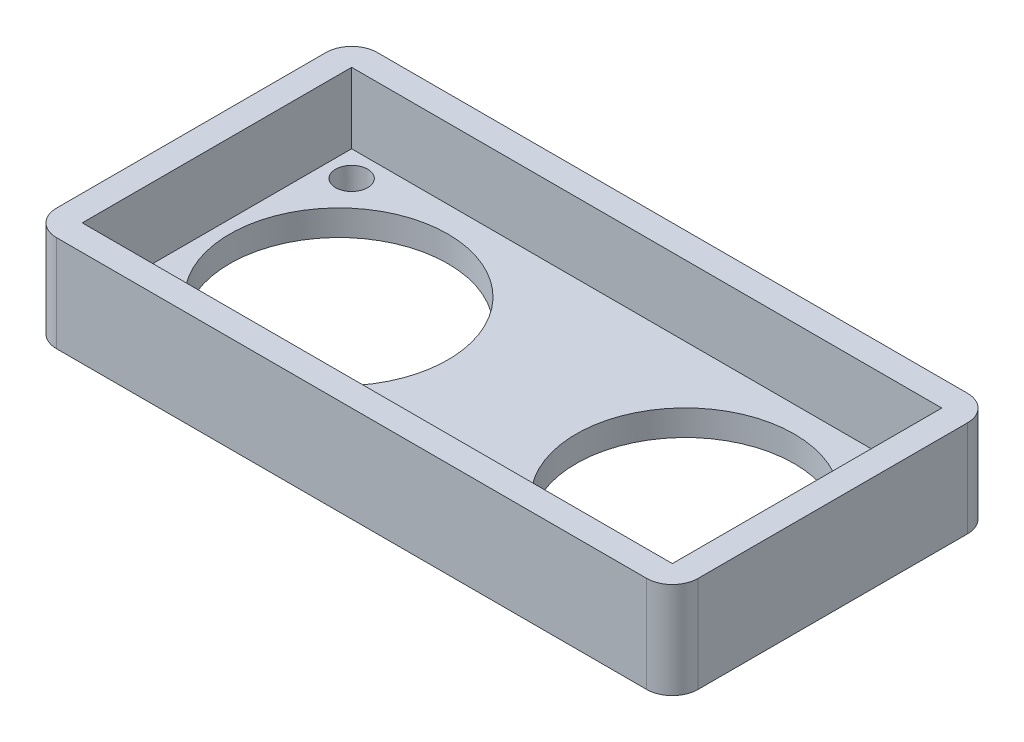
ISO-10303-21;
HEADER;
FILE_DESCRIPTION(('STEP AP214'),'2;1');
FILE_NAME('part.step','',(''),(''),'','','');
FILE_SCHEMA(('AUTOMOTIVE_DESIGN { 1 0 10303 214 1 1 1 1 }'));
ENDSEC;
DATA;
#1=APPLICATION_CONTEXT('core data for automotive mechanical design processes');
#2=APPLICATION_PROTOCOL_DEFINITION('international standard','automotive_design',2000,#1);
#3=PRODUCT_CONTEXT('',#1,'mechanical');
#4=PRODUCT('Part','Part','',(#3));
#5=PRODUCT_RELATED_PRODUCT_CATEGORY('part','',(#4));
#6=PRODUCT_DEFINITION_FORMATION('','',#4);
#7=PRODUCT_DEFINITION_CONTEXT('part definition',#1,'design');
#8=PRODUCT_DEFINITION('design','',#6,#7);
#9=PRODUCT_DEFINITION_SHAPE('','',#8);
#10=(LENGTH_UNIT() NAMED_UNIT(*) SI_UNIT(.MILLI.,.METRE.));
#11=(NAMED_UNIT(*) PLANE_ANGLE_UNIT() SI_UNIT($,.RADIAN.));
#12=(NAMED_UNIT(*) SI_UNIT($,.STERADIAN.) SOLID_ANGLE_UNIT());
#13=UNCERTAINTY_MEASURE_WITH_UNIT(LENGTH_MEASURE(1.E-05),#10,'distance_accuracy_value','');
#14=(GEOMETRIC_REPRESENTATION_CONTEXT(3) GLOBAL_UNCERTAINTY_ASSIGNED_CONTEXT((#13)) GLOBAL_UNIT_ASSIGNED_CONTEXT((#10,
#11,#12)) REPRESENTATION_CONTEXT('',''));
#15=CARTESIAN_POINT('',(0.,0.,0.));
#16=DIRECTION('',(0.,0.,1.));
#17=DIRECTION('',(1.,0.,0.));
#18=AXIS2_PLACEMENT_3D('',#15,#16,#17);
#19=CARTESIAN_POINT('',(23.,2.,-10.5));
#20=DIRECTION('',(0.,-1.,0.));
#21=DIRECTION('',(0.,0.,-1.));
#22=AXIS2_PLACEMENT_3D('',#19,#20,#21);
#23=CYLINDRICAL_SURFACE('',#22,2.);
#24=CARTESIAN_POINT('',(23.,0.,-10.5));
#25=DIRECTION('',(0.,1.,0.));
#26=DIRECTION('',(0.,0.,1.));
#27=AXIS2_PLACEMENT_3D('',#24,#25,#26);
#28=CIRCLE('',#27,2.);
#29=CARTESIAN_POINT('',(25.,0.,-10.5));
#30=VERTEX_POINT('',#29);
#31=CARTESIAN_POINT('',(23.,0.,-12.5));
#32=VERTEX_POINT('',#31);
#33=EDGE_CURVE('E186',#30,#32,#28,.T.);
#34=ORIENTED_EDGE('',*,*,#33,.T.);
#35=DIRECTION('',(0.,-1.,0.));
#36=VECTOR('',#35,1.);
#37=CARTESIAN_POINT('',(23.,2.,-12.5));
#38=LINE('',#37,#36);
#39=CARTESIAN_POINT('',(23.,7.5,-12.5));
#40=VERTEX_POINT('',#39);
#41=EDGE_CURVE('E11',#40,#32,#38,.T.);
#42=ORIENTED_EDGE('',*,*,#41,.F.);
#43=CARTESIAN_POINT('',(23.,7.5,-10.5));
#44=DIRECTION('',(0.,1.,0.));
#45=DIRECTION('',(0.,0.,1.));
#46=AXIS2_PLACEMENT_3D('',#43,#44,#45);
#47=CIRCLE('',#46,2.);
#48=CARTESIAN_POINT('',(25.,7.5,-10.5));
#49=VERTEX_POINT('',#48);
#50=EDGE_CURVE('E139',#49,#40,#47,.T.);
#51=ORIENTED_EDGE('',*,*,#50,.F.);
#52=DIRECTION('',(0.,-1.,0.));
#53=VECTOR('',#52,1.);
#54=CARTESIAN_POINT('',(25.,2.,-10.5));
#55=LINE('',#54,#53);
#56=EDGE_CURVE('E203',#49,#30,#55,.T.);
#57=ORIENTED_EDGE('',*,*,#56,.T.);
#58=EDGE_LOOP('',(#34,#42,#51,#57));
#59=FACE_BOUND('',#58,.T.);
#60=ADVANCED_FACE('F35',(#59),#23,.T.);
#61=CARTESIAN_POINT('',(-23.,2.,-12.5));
#62=DIRECTION('',(0.,0.,1.));
#63=DIRECTION('',(1.,0.,0.));
#64=AXIS2_PLACEMENT_3D('',#61,#62,#63);
#65=PLANE('',#64);
#66=DIRECTION('',(-1.,0.,0.));
#67=VECTOR('',#66,1.);
#68=CARTESIAN_POINT('',(-23.,0.,-12.5));
#69=LINE('',#68,#67);
#70=CARTESIAN_POINT('',(-23.,0.,-12.5));
#71=VERTEX_POINT('',#70);
#72=EDGE_CURVE('E189',#32,#71,#69,.T.);
#73=ORIENTED_EDGE('',*,*,#72,.T.);
#74=DIRECTION('',(0.,-1.,0.));
#75=VECTOR('',#74,1.);
#76=CARTESIAN_POINT('',(-23.,2.,-12.5));
#77=LINE('',#76,#75);
#78=CARTESIAN_POINT('',(-23.,7.5,-12.5));
#79=VERTEX_POINT('',#78);
#80=EDGE_CURVE('E43',#79,#71,#77,.T.);
#81=ORIENTED_EDGE('',*,*,#80,.F.);
#82=DIRECTION('',(-1.,0.,0.));
#83=VECTOR('',#82,1.);
#84=CARTESIAN_POINT('',(23.,7.5,-12.5));
#85=LINE('',#84,#83);
#86=EDGE_CURVE('E165',#40,#79,#85,.T.);
#87=ORIENTED_EDGE('',*,*,#86,.F.);
#88=ORIENTED_EDGE('',*,*,#41,.T.);
#89=EDGE_LOOP('',(#73,#81,#87,#88));
#90=FACE_BOUND('',#89,.T.);
#91=ADVANCED_FACE('F296',(#90),#65,.F.);
#92=CARTESIAN_POINT('',(-23.,2.,-10.5));
#93=DIRECTION('',(0.,-1.,0.));
#94=DIRECTION('',(0.,0.,-1.));
#95=AXIS2_PLACEMENT_3D('',#92,#93,#94);
#96=CYLINDRICAL_SURFACE('',#95,2.);
#97=CARTESIAN_POINT('',(-23.,0.,-10.5));
#98=DIRECTION('',(0.,1.,0.));
#99=DIRECTION('',(0.,0.,1.));
#100=AXIS2_PLACEMENT_3D('',#97,#98,#99);
#101=CIRCLE('',#100,2.);
#102=CARTESIAN_POINT('',(-25.,0.,-10.5));
#103=VERTEX_POINT('',#102);
#104=EDGE_CURVE('E191',#71,#103,#101,.T.);
#105=ORIENTED_EDGE('',*,*,#104,.T.);
#106=DIRECTION('',(0.,-1.,0.));
#107=VECTOR('',#106,1.);
#108=CARTESIAN_POINT('',(-25.,2.,-10.5));
#109=LINE('',#108,#107);
#110=CARTESIAN_POINT('',(-25.,7.5,-10.5));
#111=VERTEX_POINT('',#110);
#112=EDGE_CURVE('E218',#111,#103,#109,.T.);
#113=ORIENTED_EDGE('',*,*,#112,.F.);
#114=CARTESIAN_POINT('',(-23.,7.5,-10.5));
#115=DIRECTION('',(0.,1.,0.));
#116=DIRECTION('',(0.,0.,1.));
#117=AXIS2_PLACEMENT_3D('',#114,#115,#116);
#118=CIRCLE('',#117,2.);
#119=EDGE_CURVE('E168',#79,#111,#118,.T.);
#120=ORIENTED_EDGE('',*,*,#119,.F.);
#121=ORIENTED_EDGE('',*,*,#80,.T.);
#122=EDGE_LOOP('',(#105,#113,#120,#121));
#123=FACE_BOUND('',#122,.T.);
#124=ADVANCED_FACE('F294',(#123),#96,.T.);
#125=CARTESIAN_POINT('',(-25.,2.,-10.5));
#126=DIRECTION('',(1.,0.,0.));
#127=DIRECTION('',(0.,0.,-1.));
#128=AXIS2_PLACEMENT_3D('',#125,#126,#127);
#129=PLANE('',#128);
#130=DIRECTION('',(0.,0.,1.));
#131=VECTOR('',#130,1.);
#132=CARTESIAN_POINT('',(-25.,0.,-10.5));
#133=LINE('',#132,#131);
#134=CARTESIAN_POINT('',(-25.,0.,10.5));
#135=VERTEX_POINT('',#134);
#136=EDGE_CURVE('E193',#103,#135,#133,.T.);
#137=ORIENTED_EDGE('',*,*,#136,.T.);
#138=DIRECTION('',(0.,-1.,0.));
#139=VECTOR('',#138,1.);
#140=CARTESIAN_POINT('',(-25.,2.,10.5));
#141=LINE('',#140,#139);
#142=CARTESIAN_POINT('',(-25.,7.5,10.5));
#143=VERTEX_POINT('',#142);
#144=EDGE_CURVE('E215',#143,#135,#141,.T.);
#145=ORIENTED_EDGE('',*,*,#144,.F.);
#146=DIRECTION('',(0.,0.,1.));
#147=VECTOR('',#146,1.);
#148=CARTESIAN_POINT('',(-25.,7.5,-10.5));
#149=LINE('',#148,#147);
#150=EDGE_CURVE('E171',#111,#143,#149,.T.);
#151=ORIENTED_EDGE('',*,*,#150,.F.);
#152=ORIENTED_EDGE('',*,*,#112,.T.);
#153=EDGE_LOOP('',(#137,#145,#151,#152));
#154=FACE_BOUND('',#153,.T.);
#155=ADVANCED_FACE('F292',(#154),#129,.F.);
#156=CARTESIAN_POINT('',(-23.,2.,10.5));
#157=DIRECTION('',(0.,-1.,0.));
#158=DIRECTION('',(0.,0.,-1.));
#159=AXIS2_PLACEMENT_3D('',#156,#157,#158);
#160=CYLINDRICAL_SURFACE('',#159,2.);
#161=CARTESIAN_POINT('',(-23.,0.,10.5));
#162=DIRECTION('',(0.,1.,0.));
#163=DIRECTION('',(0.,0.,1.));
#164=AXIS2_PLACEMENT_3D('',#161,#162,#163);
#165=CIRCLE('',#164,2.);
#166=CARTESIAN_POINT('',(-23.,0.,12.5));
#167=VERTEX_POINT('',#166);
#168=EDGE_CURVE('E195',#135,#167,#165,.T.);
#169=ORIENTED_EDGE('',*,*,#168,.T.);
#170=DIRECTION('',(0.,-1.,0.));
#171=VECTOR('',#170,1.);
#172=CARTESIAN_POINT('',(-23.,2.,12.5));
#173=LINE('',#172,#171);
#174=CARTESIAN_POINT('',(-23.,7.5,12.5));
#175=VERTEX_POINT('',#174);
#176=EDGE_CURVE('E212',#175,#167,#173,.T.);
#177=ORIENTED_EDGE('',*,*,#176,.F.);
#178=CARTESIAN_POINT('',(-23.,7.5,10.5));
#179=DIRECTION('',(0.,1.,0.));
#180=DIRECTION('',(0.,0.,1.));
#181=AXIS2_PLACEMENT_3D('',#178,#179,#180);
#182=CIRCLE('',#181,2.);
#183=EDGE_CURVE('E174',#143,#175,#182,.T.);
#184=ORIENTED_EDGE('',*,*,#183,.F.);
#185=ORIENTED_EDGE('',*,*,#144,.T.);
#186=EDGE_LOOP('',(#169,#177,#184,#185));
#187=FACE_BOUND('',#186,.T.);
#188=ADVANCED_FACE('F288',(#187),#160,.T.);
#189=CARTESIAN_POINT('',(-23.,2.,12.5));
#190=DIRECTION('',(0.,0.,-1.));
#191=DIRECTION('',(-1.,0.,0.));
#192=AXIS2_PLACEMENT_3D('',#189,#190,#191);
#193=PLANE('',#192);
#194=DIRECTION('',(1.,0.,0.));
#195=VECTOR('',#194,1.);
#196=CARTESIAN_POINT('',(-23.,0.,12.5));
#197=LINE('',#196,#195);
#198=CARTESIAN_POINT('',(23.,0.,12.5));
#199=VERTEX_POINT('',#198);
#200=EDGE_CURVE('E197',#167,#199,#197,.T.);
#201=ORIENTED_EDGE('',*,*,#200,.T.);
#202=DIRECTION('',(0.,-1.,0.));
#203=VECTOR('',#202,1.);
#204=CARTESIAN_POINT('',(23.,2.,12.5));
#205=LINE('',#204,#203);
#206=CARTESIAN_POINT('',(23.,7.5,12.5));
#207=VERTEX_POINT('',#206);
#208=EDGE_CURVE('E209',#207,#199,#205,.T.);
#209=ORIENTED_EDGE('',*,*,#208,.F.);
#210=DIRECTION('',(1.,0.,0.));
#211=VECTOR('',#210,1.);
#212=CARTESIAN_POINT('',(-23.,7.5,12.5));
#213=LINE('',#212,#211);
#214=EDGE_CURVE('E177',#175,#207,#213,.T.);
#215=ORIENTED_EDGE('',*,*,#214,.F.);
#216=ORIENTED_EDGE('',*,*,#176,.T.);
#217=EDGE_LOOP('',(#201,#209,#215,#216));
#218=FACE_BOUND('',#217,.T.);
#219=ADVANCED_FACE('F285',(#218),#193,.F.);
#220=CARTESIAN_POINT('',(23.,2.,10.5));
#221=DIRECTION('',(0.,-1.,0.));
#222=DIRECTION('',(0.,0.,-1.));
#223=AXIS2_PLACEMENT_3D('',#220,#221,#222);
#224=CYLINDRICAL_SURFACE('',#223,2.);
#225=CARTESIAN_POINT('',(23.,0.,10.5));
#226=DIRECTION('',(0.,1.,0.));
#227=DIRECTION('',(0.,0.,1.));
#228=AXIS2_PLACEMENT_3D('',#225,#226,#227);
#229=CIRCLE('',#228,2.);
#230=CARTESIAN_POINT('',(25.,0.,10.5));
#231=VERTEX_POINT('',#230);
#232=EDGE_CURVE('E199',#199,#231,#229,.T.);
#233=ORIENTED_EDGE('',*,*,#232,.T.);
#234=DIRECTION('',(0.,-1.,0.));
#235=VECTOR('',#234,1.);
#236=CARTESIAN_POINT('',(25.,2.,10.5));
#237=LINE('',#236,#235);
#238=CARTESIAN_POINT('',(25.,7.5,10.5));
#239=VERTEX_POINT('',#238);
#240=EDGE_CURVE('E206',#239,#231,#237,.T.);
#241=ORIENTED_EDGE('',*,*,#240,.F.);
#242=CARTESIAN_POINT('',(23.,7.5,10.5));
#243=DIRECTION('',(0.,1.,0.));
#244=DIRECTION('',(0.,0.,1.));
#245=AXIS2_PLACEMENT_3D('',#242,#243,#244);
#246=CIRCLE('',#245,2.);
#247=EDGE_CURVE('E180',#207,#239,#246,.T.);
#248=ORIENTED_EDGE('',*,*,#247,.F.);
#249=ORIENTED_EDGE('',*,*,#208,.T.);
#250=EDGE_LOOP('',(#233,#241,#248,#249));
#251=FACE_BOUND('',#250,.T.);
#252=ADVANCED_FACE('F280',(#251),#224,.T.);
#253=CARTESIAN_POINT('',(25.,2.,-10.5));
#254=DIRECTION('',(-1.,0.,0.));
#255=DIRECTION('',(0.,0.,1.));
#256=AXIS2_PLACEMENT_3D('',#253,#254,#255);
#257=PLANE('',#256);
#258=DIRECTION('',(0.,0.,-1.));
#259=VECTOR('',#258,1.);
#260=CARTESIAN_POINT('',(25.,0.,-10.5));
#261=LINE('',#260,#259);
#262=EDGE_CURVE('E201',#231,#30,#261,.T.);
#263=ORIENTED_EDGE('',*,*,#262,.T.);
#264=ORIENTED_EDGE('',*,*,#56,.F.);
#265=DIRECTION('',(0.,0.,-1.));
#266=VECTOR('',#265,1.);
#267=CARTESIAN_POINT('',(25.,7.5,10.5));
#268=LINE('',#267,#266);
#269=EDGE_CURVE('E183',#239,#49,#268,.T.);
#270=ORIENTED_EDGE('',*,*,#269,.F.);
#271=ORIENTED_EDGE('',*,*,#240,.T.);
#272=EDGE_LOOP('',(#263,#264,#270,#271));
#273=FACE_BOUND('',#272,.T.);
#274=ADVANCED_FACE('F264',(#273),#257,.F.);
#275=CARTESIAN_POINT('',(23.,0.,-10.5));
#276=DIRECTION('',(0.,1.,0.));
#277=DIRECTION('',(0.,0.,1.));
#278=AXIS2_PLACEMENT_3D('',#275,#276,#277);
#279=PLANE('',#278);
#280=CARTESIAN_POINT('',(-13.5,0.,0.));
#281=DIRECTION('',(0.,-1.,0.));
#282=DIRECTION('',(0.,0.,-1.));
#283=AXIS2_PLACEMENT_3D('',#280,#281,#282);
#284=CIRCLE('',#283,8.5);
#285=CARTESIAN_POINT('',(-13.5,0.,-8.5));
#286=VERTEX_POINT('',#285);
#287=EDGE_CURVE('E236',#286,#286,#284,.T.);
#288=ORIENTED_EDGE('',*,*,#287,.F.);
#289=EDGE_LOOP('',(#288));
#290=FACE_BOUND('',#289,.T.);
#291=CARTESIAN_POINT('',(13.5,0.,0.));
#292=DIRECTION('',(0.,-1.,0.));
#293=DIRECTION('',(0.,0.,-1.));
#294=AXIS2_PLACEMENT_3D('',#291,#292,#293);
#295=CIRCLE('',#294,8.5);
#296=CARTESIAN_POINT('',(13.5,0.,-8.5));
#297=VERTEX_POINT('',#296);
#298=EDGE_CURVE('E242',#297,#297,#295,.T.);
#299=ORIENTED_EDGE('',*,*,#298,.F.);
#300=EDGE_LOOP('',(#299));
#301=FACE_BOUND('',#300,.T.);
#302=CARTESIAN_POINT('',(-21.,0.,-8.5));
#303=DIRECTION('',(0.,-1.,0.));
#304=DIRECTION('',(0.,0.,-1.));
#305=AXIS2_PLACEMENT_3D('',#302,#303,#304);
#306=CIRCLE('',#305,1.25);
#307=CARTESIAN_POINT('',(-21.,0.,-9.75));
#308=VERTEX_POINT('',#307);
#309=EDGE_CURVE('E252',#308,#308,#306,.T.);
#310=ORIENTED_EDGE('',*,*,#309,.F.);
#311=EDGE_LOOP('',(#310));
#312=FACE_BOUND('',#311,.T.);
#313=CARTESIAN_POINT('',(21.,0.,8.5));
#314=DIRECTION('',(0.,-1.,0.));
#315=DIRECTION('',(0.,0.,-1.));
#316=AXIS2_PLACEMENT_3D('',#313,#314,#315);
#317=CIRCLE('',#316,1.25);
#318=CARTESIAN_POINT('',(21.,0.,7.25));
#319=VERTEX_POINT('',#318);
#320=EDGE_CURVE('E251',#319,#319,#317,.T.);
#321=ORIENTED_EDGE('',*,*,#320,.F.);
#322=EDGE_LOOP('',(#321));
#323=FACE_BOUND('',#322,.T.);
#324=CARTESIAN_POINT('',(21.,0.,-8.5));
#325=DIRECTION('',(0.,-1.,0.));
#326=DIRECTION('',(0.,0.,-1.));
#327=AXIS2_PLACEMENT_3D('',#324,#325,#326);
#328=CIRCLE('',#327,1.25);
#329=CARTESIAN_POINT('',(21.,0.,-9.75));
#330=VERTEX_POINT('',#329);
#331=EDGE_CURVE('E240',#330,#330,#328,.T.);
#332=ORIENTED_EDGE('',*,*,#331,.F.);
#333=EDGE_LOOP('',(#332));
#334=FACE_BOUND('',#333,.T.);
#335=CARTESIAN_POINT('',(-21.,0.,8.5));
#336=DIRECTION('',(0.,-1.,0.));
#337=DIRECTION('',(0.,0.,-1.));
#338=AXIS2_PLACEMENT_3D('',#335,#336,#337);
#339=CIRCLE('',#338,1.25);
#340=CARTESIAN_POINT('',(-21.,0.,7.25));
#341=VERTEX_POINT('',#340);
#342=EDGE_CURVE('E227',#341,#341,#339,.T.);
#343=ORIENTED_EDGE('',*,*,#342,.F.);
#344=EDGE_LOOP('',(#343));
#345=FACE_BOUND('',#344,.T.);
#346=ORIENTED_EDGE('',*,*,#33,.F.);
#347=ORIENTED_EDGE('',*,*,#262,.F.);
#348=ORIENTED_EDGE('',*,*,#232,.F.);
#349=ORIENTED_EDGE('',*,*,#200,.F.);
#350=ORIENTED_EDGE('',*,*,#168,.F.);
#351=ORIENTED_EDGE('',*,*,#136,.F.);
#352=ORIENTED_EDGE('',*,*,#104,.F.);
#353=ORIENTED_EDGE('',*,*,#72,.F.);
#354=EDGE_LOOP('',(#346,#347,#348,#349,#350,#351,#352,#353));
#355=FACE_BOUND('',#354,.T.);
#356=ADVANCED_FACE('F261',(#290,#301,#312,#323,#334,#345,#355),#279,.F.);
#357=CARTESIAN_POINT('',(23.,7.5,-10.5));
#358=DIRECTION('',(0.,1.,0.));
#359=DIRECTION('',(0.,0.,1.));
#360=AXIS2_PLACEMENT_3D('',#357,#358,#359);
#361=PLANE('',#360);
#362=ORIENTED_EDGE('',*,*,#50,.T.);
#363=ORIENTED_EDGE('',*,*,#86,.T.);
#364=ORIENTED_EDGE('',*,*,#119,.T.);
#365=ORIENTED_EDGE('',*,*,#150,.T.);
#366=ORIENTED_EDGE('',*,*,#183,.T.);
#367=ORIENTED_EDGE('',*,*,#214,.T.);
#368=ORIENTED_EDGE('',*,*,#247,.T.);
#369=ORIENTED_EDGE('',*,*,#269,.T.);
#370=EDGE_LOOP('',(#362,#363,#364,#365,#366,#367,#368,#369));
#371=FACE_BOUND('',#370,.T.);
#372=DIRECTION('',(-1.,0.,0.));
#373=VECTOR('',#372,1.);
#374=CARTESIAN_POINT('',(-23.,7.5,-10.5));
#375=LINE('',#374,#373);
#376=CARTESIAN_POINT('',(23.,7.5,-10.5));
#377=VERTEX_POINT('',#376);
#378=CARTESIAN_POINT('',(-23.,7.5,-10.5));
#379=VERTEX_POINT('',#378);
#380=EDGE_CURVE('E133',#377,#379,#375,.T.);
#381=ORIENTED_EDGE('',*,*,#380,.F.);
#382=DIRECTION('',(0.,0.,-1.));
#383=VECTOR('',#382,1.);
#384=CARTESIAN_POINT('',(23.,7.5,-10.5));
#385=LINE('',#384,#383);
#386=CARTESIAN_POINT('',(23.,7.5,10.5));
#387=VERTEX_POINT('',#386);
#388=EDGE_CURVE('E124',#387,#377,#385,.T.);
#389=ORIENTED_EDGE('',*,*,#388,.F.);
#390=DIRECTION('',(1.,0.,0.));
#391=VECTOR('',#390,1.);
#392=CARTESIAN_POINT('',(-23.,7.5,10.5));
#393=LINE('',#392,#391);
#394=CARTESIAN_POINT('',(-23.,7.5,10.5));
#395=VERTEX_POINT('',#394);
#396=EDGE_CURVE('E147',#395,#387,#393,.T.);
#397=ORIENTED_EDGE('',*,*,#396,.F.);
#398=DIRECTION('',(0.,0.,1.));
#399=VECTOR('',#398,1.);
#400=CARTESIAN_POINT('',(-23.,7.5,-10.5));
#401=LINE('',#400,#399);
#402=EDGE_CURVE('E145',#379,#395,#401,.T.);
#403=ORIENTED_EDGE('',*,*,#402,.F.);
#404=EDGE_LOOP('',(#381,#389,#397,#403));
#405=FACE_BOUND('',#404,.T.);
#406=ADVANCED_FACE('F143',(#371,#405),#361,.T.);
#407=CARTESIAN_POINT('',(23.,7.5,-10.5));
#408=DIRECTION('',(-1.,0.,0.));
#409=DIRECTION('',(0.,0.,1.));
#410=AXIS2_PLACEMENT_3D('',#407,#408,#409);
#411=PLANE('',#410);
#412=DIRECTION('',(0.,0.,-1.));
#413=VECTOR('',#412,1.);
#414=CARTESIAN_POINT('',(23.,2.,-10.5));
#415=LINE('',#414,#413);
#416=CARTESIAN_POINT('',(23.,2.,10.5));
#417=VERTEX_POINT('',#416);
#418=CARTESIAN_POINT('',(23.,2.,-10.5));
#419=VERTEX_POINT('',#418);
#420=EDGE_CURVE('E51',#417,#419,#415,.T.);
#421=ORIENTED_EDGE('',*,*,#420,.F.);
#422=DIRECTION('',(0.,-1.,0.));
#423=VECTOR('',#422,1.);
#424=CARTESIAN_POINT('',(23.,7.5,10.5));
#425=LINE('',#424,#423);
#426=EDGE_CURVE('E129',#387,#417,#425,.T.);
#427=ORIENTED_EDGE('',*,*,#426,.F.);
#428=ORIENTED_EDGE('',*,*,#388,.T.);
#429=DIRECTION('',(0.,-1.,0.));
#430=VECTOR('',#429,1.);
#431=CARTESIAN_POINT('',(23.,7.5,-10.5));
#432=LINE('',#431,#430);
#433=EDGE_CURVE('E127',#377,#419,#432,.T.);
#434=ORIENTED_EDGE('',*,*,#433,.T.);
#435=EDGE_LOOP('',(#421,#427,#428,#434));
#436=FACE_BOUND('',#435,.T.);
#437=ADVANCED_FACE('F126',(#436),#411,.T.);
#438=CARTESIAN_POINT('',(-23.,7.5,-10.5));
#439=DIRECTION('',(0.,0.,1.));
#440=DIRECTION('',(1.,0.,0.));
#441=AXIS2_PLACEMENT_3D('',#438,#439,#440);
#442=PLANE('',#441);
#443=DIRECTION('',(-1.,0.,0.));
#444=VECTOR('',#443,1.);
#445=CARTESIAN_POINT('',(-23.,2.,-10.5));
#446=LINE('',#445,#444);
#447=CARTESIAN_POINT('',(-23.,2.,-10.5));
#448=VERTEX_POINT('',#447);
#449=EDGE_CURVE('E55',#419,#448,#446,.T.);
#450=ORIENTED_EDGE('',*,*,#449,.F.);
#451=ORIENTED_EDGE('',*,*,#433,.F.);
#452=ORIENTED_EDGE('',*,*,#380,.T.);
#453=DIRECTION('',(0.,-1.,0.));
#454=VECTOR('',#453,1.);
#455=CARTESIAN_POINT('',(-23.,7.5,-10.5));
#456=LINE('',#455,#454);
#457=EDGE_CURVE('E140',#379,#448,#456,.T.);
#458=ORIENTED_EDGE('',*,*,#457,.T.);
#459=EDGE_LOOP('',(#450,#451,#452,#458));
#460=FACE_BOUND('',#459,.T.);
#461=ADVANCED_FACE('F137',(#460),#442,.T.);
#462=CARTESIAN_POINT('',(-23.,7.5,-10.5));
#463=DIRECTION('',(1.,0.,0.));
#464=DIRECTION('',(0.,0.,-1.));
#465=AXIS2_PLACEMENT_3D('',#462,#463,#464);
#466=PLANE('',#465);
#467=DIRECTION('',(0.,0.,1.));
#468=VECTOR('',#467,1.);
#469=CARTESIAN_POINT('',(-23.,2.,-10.5));
#470=LINE('',#469,#468);
#471=CARTESIAN_POINT('',(-23.,2.,10.5));
#472=VERTEX_POINT('',#471);
#473=EDGE_CURVE('E155',#448,#472,#470,.T.);
#474=ORIENTED_EDGE('',*,*,#473,.F.);
#475=ORIENTED_EDGE('',*,*,#457,.F.);
#476=ORIENTED_EDGE('',*,*,#402,.T.);
#477=DIRECTION('',(0.,-1.,0.));
#478=VECTOR('',#477,1.);
#479=CARTESIAN_POINT('',(-23.,7.5,10.5));
#480=LINE('',#479,#478);
#481=EDGE_CURVE('E159',#395,#472,#480,.T.);
#482=ORIENTED_EDGE('',*,*,#481,.T.);
#483=EDGE_LOOP('',(#474,#475,#476,#482));
#484=FACE_BOUND('',#483,.T.);
#485=ADVANCED_FACE('F325',(#484),#466,.T.);
#486=CARTESIAN_POINT('',(-23.,7.5,10.5));
#487=DIRECTION('',(0.,0.,-1.));
#488=DIRECTION('',(-1.,0.,0.));
#489=AXIS2_PLACEMENT_3D('',#486,#487,#488);
#490=PLANE('',#489);
#491=DIRECTION('',(1.,0.,0.));
#492=VECTOR('',#491,1.);
#493=CARTESIAN_POINT('',(-23.,2.,10.5));
#494=LINE('',#493,#492);
#495=EDGE_CURVE('E134',#472,#417,#494,.T.);
#496=ORIENTED_EDGE('',*,*,#495,.F.);
#497=ORIENTED_EDGE('',*,*,#481,.F.);
#498=ORIENTED_EDGE('',*,*,#396,.T.);
#499=ORIENTED_EDGE('',*,*,#426,.T.);
#500=EDGE_LOOP('',(#496,#497,#498,#499));
#501=FACE_BOUND('',#500,.T.);
#502=ADVANCED_FACE('F317',(#501),#490,.T.);
#503=CARTESIAN_POINT('',(23.,2.,-10.5));
#504=DIRECTION('',(0.,1.,0.));
#505=DIRECTION('',(0.,0.,1.));
#506=AXIS2_PLACEMENT_3D('',#503,#504,#505);
#507=PLANE('',#506);
#508=CARTESIAN_POINT('',(-13.5,2.,0.));
#509=DIRECTION('',(0.,1.,0.));
#510=DIRECTION('',(0.,0.,1.));
#511=AXIS2_PLACEMENT_3D('',#508,#509,#510);
#512=CIRCLE('',#511,8.5);
#513=CARTESIAN_POINT('',(-13.5,2.,8.5));
#514=VERTEX_POINT('',#513);
#515=EDGE_CURVE('E38',#514,#514,#512,.T.);
#516=ORIENTED_EDGE('',*,*,#515,.F.);
#517=EDGE_LOOP('',(#516));
#518=FACE_BOUND('',#517,.T.);
#519=CARTESIAN_POINT('',(13.5,2.,0.));
#520=DIRECTION('',(0.,1.,0.));
#521=DIRECTION('',(0.,0.,1.));
#522=AXIS2_PLACEMENT_3D('',#519,#520,#521);
#523=CIRCLE('',#522,8.5);
#524=CARTESIAN_POINT('',(13.5,2.,8.5));
#525=VERTEX_POINT('',#524);
#526=EDGE_CURVE('E234',#525,#525,#523,.T.);
#527=ORIENTED_EDGE('',*,*,#526,.F.);
#528=EDGE_LOOP('',(#527));
#529=FACE_BOUND('',#528,.T.);
#530=CARTESIAN_POINT('',(-21.,2.,-8.5));
#531=DIRECTION('',(0.,1.,0.));
#532=DIRECTION('',(0.,0.,1.));
#533=AXIS2_PLACEMENT_3D('',#530,#531,#532);
#534=CIRCLE('',#533,1.25);
#535=CARTESIAN_POINT('',(-21.,2.,-7.25));
#536=VERTEX_POINT('',#535);
#537=EDGE_CURVE('E153',#536,#536,#534,.T.);
#538=ORIENTED_EDGE('',*,*,#537,.F.);
#539=EDGE_LOOP('',(#538));
#540=FACE_BOUND('',#539,.T.);
#541=CARTESIAN_POINT('',(21.,2.,8.5));
#542=DIRECTION('',(0.,1.,0.));
#543=DIRECTION('',(0.,0.,1.));
#544=AXIS2_PLACEMENT_3D('',#541,#542,#543);
#545=CIRCLE('',#544,1.25);
#546=CARTESIAN_POINT('',(21.,2.,9.75));
#547=VERTEX_POINT('',#546);
#548=EDGE_CURVE('E230',#547,#547,#545,.T.);
#549=ORIENTED_EDGE('',*,*,#548,.F.);
#550=EDGE_LOOP('',(#549));
#551=FACE_BOUND('',#550,.T.);
#552=CARTESIAN_POINT('',(21.,2.,-8.5));
#553=DIRECTION('',(0.,1.,0.));
#554=DIRECTION('',(0.,0.,1.));
#555=AXIS2_PLACEMENT_3D('',#552,#553,#554);
#556=CIRCLE('',#555,1.25);
#557=CARTESIAN_POINT('',(21.,2.,-7.25));
#558=VERTEX_POINT('',#557);
#559=EDGE_CURVE('E226',#558,#558,#556,.T.);
#560=ORIENTED_EDGE('',*,*,#559,.F.);
#561=EDGE_LOOP('',(#560));
#562=FACE_BOUND('',#561,.T.);
#563=CARTESIAN_POINT('',(-21.,2.,8.5));
#564=DIRECTION('',(0.,1.,0.));
#565=DIRECTION('',(0.,0.,1.));
#566=AXIS2_PLACEMENT_3D('',#563,#564,#565);
#567=CIRCLE('',#566,1.25);
#568=CARTESIAN_POINT('',(-21.,2.,9.75));
#569=VERTEX_POINT('',#568);
#570=EDGE_CURVE('E223',#569,#569,#567,.T.);
#571=ORIENTED_EDGE('',*,*,#570,.F.);
#572=EDGE_LOOP('',(#571));
#573=FACE_BOUND('',#572,.T.);
#574=ORIENTED_EDGE('',*,*,#420,.T.);
#575=ORIENTED_EDGE('',*,*,#449,.T.);
#576=ORIENTED_EDGE('',*,*,#473,.T.);
#577=ORIENTED_EDGE('',*,*,#495,.T.);
#578=EDGE_LOOP('',(#574,#575,#576,#577));
#579=FACE_BOUND('',#578,.T.);
#580=ADVANCED_FACE('F314',(#518,#529,#540,#551,#562,#573,#579),#507,.T.);
#581=CARTESIAN_POINT('',(-21.,7.5,8.5));
#582=DIRECTION('',(0.,-1.,0.));
#583=DIRECTION('',(0.,0.,-1.));
#584=AXIS2_PLACEMENT_3D('',#581,#582,#583);
#585=CYLINDRICAL_SURFACE('',#584,1.25);
#586=ORIENTED_EDGE('',*,*,#570,.T.);
#587=EDGE_LOOP('',(#586));
#588=FACE_BOUND('',#587,.T.);
#589=ORIENTED_EDGE('',*,*,#342,.T.);
#590=EDGE_LOOP('',(#589));
#591=FACE_BOUND('',#590,.T.);
#592=ADVANCED_FACE('F259',(#588,#591),#585,.F.);
#593=CARTESIAN_POINT('',(21.,7.5,-8.5));
#594=DIRECTION('',(0.,-1.,0.));
#595=DIRECTION('',(0.,0.,-1.));
#596=AXIS2_PLACEMENT_3D('',#593,#594,#595);
#597=CYLINDRICAL_SURFACE('',#596,1.25);
#598=ORIENTED_EDGE('',*,*,#559,.T.);
#599=EDGE_LOOP('',(#598));
#600=FACE_BOUND('',#599,.T.);
#601=ORIENTED_EDGE('',*,*,#331,.T.);
#602=EDGE_LOOP('',(#601));
#603=FACE_BOUND('',#602,.T.);
#604=ADVANCED_FACE('F334',(#600,#603),#597,.F.);
#605=CARTESIAN_POINT('',(21.,7.5,8.5));
#606=DIRECTION('',(0.,-1.,0.));
#607=DIRECTION('',(0.,0.,-1.));
#608=AXIS2_PLACEMENT_3D('',#605,#606,#607);
#609=CYLINDRICAL_SURFACE('',#608,1.25);
#610=ORIENTED_EDGE('',*,*,#548,.T.);
#611=EDGE_LOOP('',(#610));
#612=FACE_BOUND('',#611,.T.);
#613=ORIENTED_EDGE('',*,*,#320,.T.);
#614=EDGE_LOOP('',(#613));
#615=FACE_BOUND('',#614,.T.);
#616=ADVANCED_FACE('F336',(#612,#615),#609,.F.);
#617=CARTESIAN_POINT('',(-21.,7.5,-8.5));
#618=DIRECTION('',(0.,-1.,0.));
#619=DIRECTION('',(0.,0.,-1.));
#620=AXIS2_PLACEMENT_3D('',#617,#618,#619);
#621=CYLINDRICAL_SURFACE('',#620,1.25);
#622=ORIENTED_EDGE('',*,*,#537,.T.);
#623=EDGE_LOOP('',(#622));
#624=FACE_BOUND('',#623,.T.);
#625=ORIENTED_EDGE('',*,*,#309,.T.);
#626=EDGE_LOOP('',(#625));
#627=FACE_BOUND('',#626,.T.);
#628=ADVANCED_FACE('F339',(#624,#627),#621,.F.);
#629=CARTESIAN_POINT('',(13.5,7.5,0.));
#630=DIRECTION('',(0.,-1.,0.));
#631=DIRECTION('',(0.,0.,-1.));
#632=AXIS2_PLACEMENT_3D('',#629,#630,#631);
#633=CYLINDRICAL_SURFACE('',#632,8.5);
#634=ORIENTED_EDGE('',*,*,#526,.T.);
#635=EDGE_LOOP('',(#634));
#636=FACE_BOUND('',#635,.T.);
#637=ORIENTED_EDGE('',*,*,#298,.T.);
#638=EDGE_LOOP('',(#637));
#639=FACE_BOUND('',#638,.T.);
#640=ADVANCED_FACE('F343',(#636,#639),#633,.F.);
#641=CARTESIAN_POINT('',(-13.5,7.5,0.));
#642=DIRECTION('',(0.,-1.,0.));
#643=DIRECTION('',(0.,0.,-1.));
#644=AXIS2_PLACEMENT_3D('',#641,#642,#643);
#645=CYLINDRICAL_SURFACE('',#644,8.5);
#646=ORIENTED_EDGE('',*,*,#515,.T.);
#647=EDGE_LOOP('',(#646));
#648=FACE_BOUND('',#647,.T.);
#649=ORIENTED_EDGE('',*,*,#287,.T.);
#650=EDGE_LOOP('',(#649));
#651=FACE_BOUND('',#650,.T.);
#652=ADVANCED_FACE('F350',(#648,#651),#645,.F.);
#653=CLOSED_SHELL('',(#60,#91,#124,#155,#188,#219,#252,#274,#356,#406,#437,#461,#485,#502,#580,
#592,#604,#616,#628,#640,#652));
#654=MANIFOLD_SOLID_BREP('B2',#653);
#655=ADVANCED_BREP_SHAPE_REPRESENTATION('',(#18,#654),#14);
#656=SHAPE_DEFINITION_REPRESENTATION(#9,#655);
ENDSEC;
END-ISO-10303-21;
